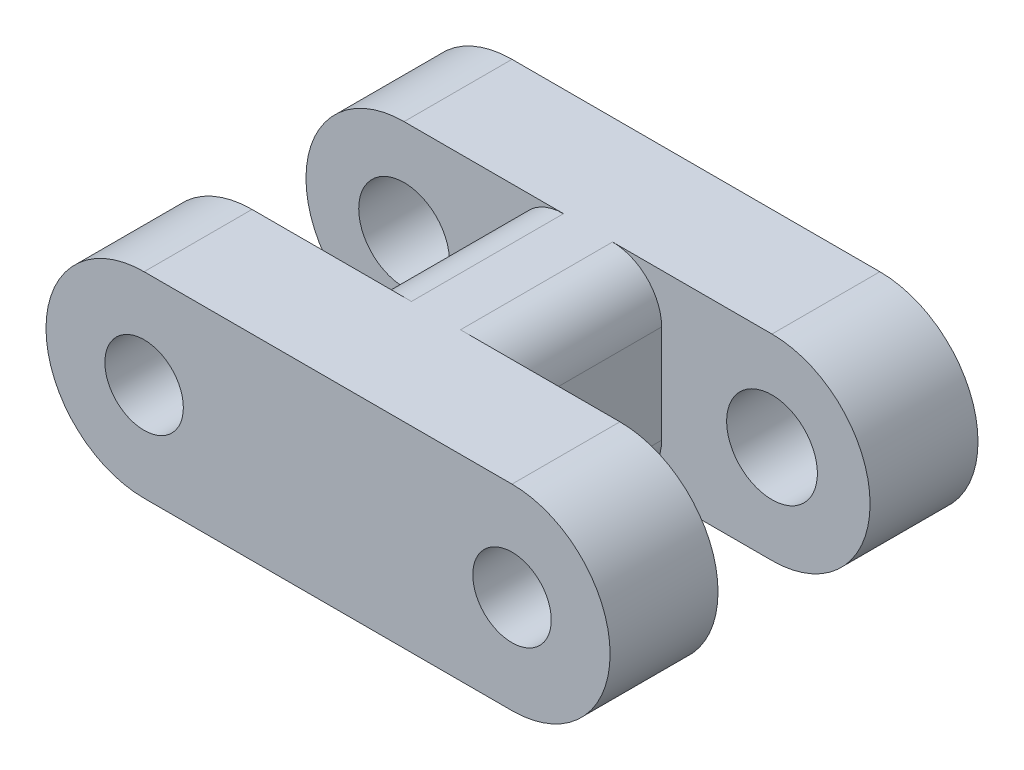
ISO-10303-21;
HEADER;
FILE_DESCRIPTION(('STEP AP214'),'2;1');
FILE_NAME('part.step','',(''),(''),'','','');
FILE_SCHEMA(('AUTOMOTIVE_DESIGN { 1 0 10303 214 1 1 1 1 }'));
ENDSEC;
DATA;
#1=APPLICATION_CONTEXT('core data for automotive mechanical design processes');
#2=APPLICATION_PROTOCOL_DEFINITION('international standard','automotive_design',2000,#1);
#3=PRODUCT_CONTEXT('',#1,'mechanical');
#4=PRODUCT('Part','Part','',(#3));
#5=PRODUCT_RELATED_PRODUCT_CATEGORY('part','',(#4));
#6=PRODUCT_DEFINITION_FORMATION('','',#4);
#7=PRODUCT_DEFINITION_CONTEXT('part definition',#1,'design');
#8=PRODUCT_DEFINITION('design','',#6,#7);
#9=PRODUCT_DEFINITION_SHAPE('','',#8);
#10=(LENGTH_UNIT() NAMED_UNIT(*) SI_UNIT(.MILLI.,.METRE.));
#11=(NAMED_UNIT(*) PLANE_ANGLE_UNIT() SI_UNIT($,.RADIAN.));
#12=(NAMED_UNIT(*) SI_UNIT($,.STERADIAN.) SOLID_ANGLE_UNIT());
#13=UNCERTAINTY_MEASURE_WITH_UNIT(LENGTH_MEASURE(1.E-05),#10,'distance_accuracy_value','');
#14=(GEOMETRIC_REPRESENTATION_CONTEXT(3) GLOBAL_UNCERTAINTY_ASSIGNED_CONTEXT((#13)) GLOBAL_UNIT_ASSIGNED_CONTEXT((#10,
#11,#12)) REPRESENTATION_CONTEXT('',''));
#15=CARTESIAN_POINT('',(0.,0.,0.));
#16=DIRECTION('',(0.,0.,1.));
#17=DIRECTION('',(1.,0.,0.));
#18=AXIS2_PLACEMENT_3D('',#15,#16,#17);
#19=CARTESIAN_POINT('',(-14.9999999999788,0.,-7.5));
#20=DIRECTION('',(0.,0.,1.));
#21=DIRECTION('',(1.,0.,0.));
#22=AXIS2_PLACEMENT_3D('',#19,#20,#21);
#23=PLANE('',#22);
#24=CARTESIAN_POINT('',(0.,0.,-7.5));
#25=DIRECTION('',(0.,0.,-1.));
#26=DIRECTION('',(-1.,0.,0.));
#27=AXIS2_PLACEMENT_3D('',#24,#25,#26);
#28=CIRCLE('',#27,1.85000000000001);
#29=CARTESIAN_POINT('',(-1.85000000000001,0.,-7.5));
#30=VERTEX_POINT('',#29);
#31=EDGE_CURVE('E303',#30,#30,#28,.T.);
#32=ORIENTED_EDGE('',*,*,#31,.F.);
#33=EDGE_LOOP('',(#32));
#34=FACE_BOUND('',#33,.T.);
#35=CARTESIAN_POINT('',(-14.9999999999788,0.,-7.5));
#36=DIRECTION('',(0.,0.,1.));
#37=DIRECTION('',(1.,0.,0.));
#38=AXIS2_PLACEMENT_3D('',#35,#36,#37);
#39=CIRCLE('',#38,4.);
#40=CARTESIAN_POINT('',(-14.9999999999788,4.,-7.5));
#41=VERTEX_POINT('',#40);
#42=CARTESIAN_POINT('',(-14.9999999999788,-4.,-7.5));
#43=VERTEX_POINT('',#42);
#44=EDGE_CURVE('E264',#41,#43,#39,.T.);
#45=ORIENTED_EDGE('',*,*,#44,.F.);
#46=DIRECTION('',(-1.,0.,0.));
#47=VECTOR('',#46,1.);
#48=CARTESIAN_POINT('',(-14.9999999999788,4.,-7.5));
#49=LINE('',#48,#47);
#50=CARTESIAN_POINT('',(0.,4.,-7.5));
#51=VERTEX_POINT('',#50);
#52=EDGE_CURVE('E269',#51,#41,#49,.T.);
#53=ORIENTED_EDGE('',*,*,#52,.F.);
#54=CARTESIAN_POINT('',(0.,0.,-7.5));
#55=DIRECTION('',(0.,0.,1.));
#56=DIRECTION('',(1.,0.,0.));
#57=AXIS2_PLACEMENT_3D('',#54,#55,#56);
#58=CIRCLE('',#57,4.);
#59=CARTESIAN_POINT('',(0.,-4.,-7.5));
#60=VERTEX_POINT('',#59);
#61=EDGE_CURVE('E278',#60,#51,#58,.T.);
#62=ORIENTED_EDGE('',*,*,#61,.F.);
#63=DIRECTION('',(1.,0.,0.));
#64=VECTOR('',#63,1.);
#65=CARTESIAN_POINT('',(0.,-4.,-7.5));
#66=LINE('',#65,#64);
#67=EDGE_CURVE('E174',#43,#60,#66,.T.);
#68=ORIENTED_EDGE('',*,*,#67,.F.);
#69=EDGE_LOOP('',(#45,#53,#62,#68));
#70=FACE_BOUND('',#69,.T.);
#71=CARTESIAN_POINT('',(-14.9999999999788,0.,-7.5));
#72=DIRECTION('',(0.,0.,-1.));
#73=DIRECTION('',(-1.,0.,0.));
#74=AXIS2_PLACEMENT_3D('',#71,#72,#73);
#75=CIRCLE('',#74,1.85000000000001);
#76=CARTESIAN_POINT('',(-16.8499999999788,0.,-7.5));
#77=VERTEX_POINT('',#76);
#78=EDGE_CURVE('E295',#77,#77,#75,.T.);
#79=ORIENTED_EDGE('',*,*,#78,.F.);
#80=EDGE_LOOP('',(#79));
#81=FACE_BOUND('',#80,.T.);
#82=ADVANCED_FACE('F39',(#34,#70,#81),#23,.F.);
#83=CARTESIAN_POINT('',(-14.9999999999788,0.,7.5));
#84=DIRECTION('',(0.,0.,-1.));
#85=DIRECTION('',(-1.,0.,0.));
#86=AXIS2_PLACEMENT_3D('',#83,#84,#85);
#87=CYLINDRICAL_SURFACE('',#86,4.);
#88=DIRECTION('',(0.,0.,-1.));
#89=VECTOR('',#88,1.);
#90=CARTESIAN_POINT('',(-14.9999999999788,-4.,7.5));
#91=LINE('',#90,#89);
#92=CARTESIAN_POINT('',(-14.9999999999788,-4.,-3.1));
#93=VERTEX_POINT('',#92);
#94=EDGE_CURVE('E180',#93,#43,#91,.T.);
#95=ORIENTED_EDGE('',*,*,#94,.F.);
#96=CARTESIAN_POINT('',(-14.9999999999788,0.,-3.1));
#97=DIRECTION('',(0.,0.,-1.));
#98=DIRECTION('',(-1.,0.,0.));
#99=AXIS2_PLACEMENT_3D('',#96,#97,#98);
#100=CIRCLE('',#99,4.);
#101=CARTESIAN_POINT('',(-14.9999999999788,4.,-3.1));
#102=VERTEX_POINT('',#101);
#103=EDGE_CURVE('E256',#93,#102,#100,.T.);
#104=ORIENTED_EDGE('',*,*,#103,.T.);
#105=DIRECTION('',(0.,0.,-1.));
#106=VECTOR('',#105,1.);
#107=CARTESIAN_POINT('',(-14.9999999999788,4.,7.5));
#108=LINE('',#107,#106);
#109=EDGE_CURVE('E244',#102,#41,#108,.T.);
#110=ORIENTED_EDGE('',*,*,#109,.T.);
#111=ORIENTED_EDGE('',*,*,#44,.T.);
#112=EDGE_LOOP('',(#95,#104,#110,#111));
#113=FACE_BOUND('',#112,.T.);
#114=ADVANCED_FACE('F285',(#113),#87,.T.);
#115=CARTESIAN_POINT('',(0.,0.,7.5));
#116=DIRECTION('',(0.,0.,-1.));
#117=DIRECTION('',(-1.,0.,0.));
#118=AXIS2_PLACEMENT_3D('',#115,#116,#117);
#119=CYLINDRICAL_SURFACE('',#118,4.);
#120=DIRECTION('',(0.,0.,-1.));
#121=VECTOR('',#120,1.);
#122=CARTESIAN_POINT('',(0.,-4.,7.5));
#123=LINE('',#122,#121);
#124=CARTESIAN_POINT('',(0.,-4.,7.5));
#125=VERTEX_POINT('',#124);
#126=CARTESIAN_POINT('',(0.,-4.,3.1));
#127=VERTEX_POINT('',#126);
#128=EDGE_CURVE('E176',#125,#127,#123,.T.);
#129=ORIENTED_EDGE('',*,*,#128,.T.);
#130=CARTESIAN_POINT('',(0.,0.,3.1));
#131=DIRECTION('',(0.,0.,1.));
#132=DIRECTION('',(1.,0.,0.));
#133=AXIS2_PLACEMENT_3D('',#130,#131,#132);
#134=CIRCLE('',#133,4.);
#135=CARTESIAN_POINT('',(0.,4.,3.1));
#136=VERTEX_POINT('',#135);
#137=EDGE_CURVE('E190',#127,#136,#134,.T.);
#138=ORIENTED_EDGE('',*,*,#137,.T.);
#139=DIRECTION('',(0.,0.,-1.));
#140=VECTOR('',#139,1.);
#141=CARTESIAN_POINT('',(0.,4.,7.5));
#142=LINE('',#141,#140);
#143=CARTESIAN_POINT('',(0.,4.,7.5));
#144=VERTEX_POINT('',#143);
#145=EDGE_CURVE('E177',#144,#136,#142,.T.);
#146=ORIENTED_EDGE('',*,*,#145,.F.);
#147=CARTESIAN_POINT('',(0.,0.,7.5));
#148=DIRECTION('',(0.,0.,1.));
#149=DIRECTION('',(1.,0.,0.));
#150=AXIS2_PLACEMENT_3D('',#147,#148,#149);
#151=CIRCLE('',#150,4.);
#152=EDGE_CURVE('E271',#125,#144,#151,.T.);
#153=ORIENTED_EDGE('',*,*,#152,.F.);
#154=EDGE_LOOP('',(#129,#138,#146,#153));
#155=FACE_BOUND('',#154,.T.);
#156=ADVANCED_FACE('F341',(#155),#119,.T.);
#157=CARTESIAN_POINT('',(0.,0.,7.5));
#158=DIRECTION('',(0.,0.,-1.));
#159=DIRECTION('',(-1.,0.,0.));
#160=AXIS2_PLACEMENT_3D('',#157,#158,#159);
#161=CYLINDRICAL_SURFACE('',#160,1.6);
#162=CARTESIAN_POINT('',(0.,0.,3.1));
#163=DIRECTION('',(0.,0.,1.));
#164=DIRECTION('',(1.,0.,0.));
#165=AXIS2_PLACEMENT_3D('',#162,#163,#164);
#166=CIRCLE('',#165,1.6);
#167=CARTESIAN_POINT('',(1.6,0.,3.1));
#168=VERTEX_POINT('',#167);
#169=EDGE_CURVE('E169',#168,#168,#166,.T.);
#170=ORIENTED_EDGE('',*,*,#169,.F.);
#171=EDGE_LOOP('',(#170));
#172=FACE_BOUND('',#171,.T.);
#173=CARTESIAN_POINT('',(0.,0.,7.5));
#174=DIRECTION('',(0.,0.,1.));
#175=DIRECTION('',(1.,0.,0.));
#176=AXIS2_PLACEMENT_3D('',#173,#174,#175);
#177=CIRCLE('',#176,1.6);
#178=CARTESIAN_POINT('',(1.6,0.,7.5));
#179=VERTEX_POINT('',#178);
#180=EDGE_CURVE('E258',#179,#179,#177,.T.);
#181=ORIENTED_EDGE('',*,*,#180,.T.);
#182=EDGE_LOOP('',(#181));
#183=FACE_BOUND('',#182,.T.);
#184=ADVANCED_FACE('F377',(#172,#183),#161,.F.);
#185=CARTESIAN_POINT('',(-14.9999999999788,0.,7.5));
#186=DIRECTION('',(0.,0.,1.));
#187=DIRECTION('',(1.,0.,0.));
#188=AXIS2_PLACEMENT_3D('',#185,#186,#187);
#189=PLANE('',#188);
#190=CARTESIAN_POINT('',(-14.9999999999788,0.,7.5));
#191=DIRECTION('',(0.,0.,1.));
#192=DIRECTION('',(1.,0.,0.));
#193=AXIS2_PLACEMENT_3D('',#190,#191,#192);
#194=CIRCLE('',#193,1.59999999997814);
#195=CARTESIAN_POINT('',(-13.4000000000006,0.,7.5));
#196=VERTEX_POINT('',#195);
#197=EDGE_CURVE('E261',#196,#196,#194,.T.);
#198=ORIENTED_EDGE('',*,*,#197,.F.);
#199=EDGE_LOOP('',(#198));
#200=FACE_BOUND('',#199,.T.);
#201=CARTESIAN_POINT('',(-14.9999999999788,0.,7.5));
#202=DIRECTION('',(0.,0.,1.));
#203=DIRECTION('',(1.,0.,0.));
#204=AXIS2_PLACEMENT_3D('',#201,#202,#203);
#205=CIRCLE('',#204,4.);
#206=CARTESIAN_POINT('',(-14.9999999999788,4.,7.5));
#207=VERTEX_POINT('',#206);
#208=CARTESIAN_POINT('',(-14.9999999999788,-4.,7.5));
#209=VERTEX_POINT('',#208);
#210=EDGE_CURVE('E265',#207,#209,#205,.T.);
#211=ORIENTED_EDGE('',*,*,#210,.T.);
#212=DIRECTION('',(1.,0.,0.));
#213=VECTOR('',#212,1.);
#214=CARTESIAN_POINT('',(0.,-4.,7.5));
#215=LINE('',#214,#213);
#216=EDGE_CURVE('E268',#209,#125,#215,.T.);
#217=ORIENTED_EDGE('',*,*,#216,.T.);
#218=ORIENTED_EDGE('',*,*,#152,.T.);
#219=DIRECTION('',(-1.,0.,0.));
#220=VECTOR('',#219,1.);
#221=CARTESIAN_POINT('',(-14.9999999999788,4.,7.5));
#222=LINE('',#221,#220);
#223=EDGE_CURVE('E273',#144,#207,#222,.T.);
#224=ORIENTED_EDGE('',*,*,#223,.T.);
#225=EDGE_LOOP('',(#211,#217,#218,#224));
#226=FACE_BOUND('',#225,.T.);
#227=ORIENTED_EDGE('',*,*,#180,.F.);
#228=EDGE_LOOP('',(#227));
#229=FACE_BOUND('',#228,.T.);
#230=ADVANCED_FACE('F336',(#200,#226,#229),#189,.T.);
#231=CARTESIAN_POINT('',(-14.9999999999788,4.,3.1));
#232=VERTEX_POINT('',#231);
#233=EDGE_CURVE('E280',#207,#232,#108,.T.);
#234=ORIENTED_EDGE('',*,*,#233,.T.);
#235=CARTESIAN_POINT('',(-14.9999999999788,0.,3.1));
#236=DIRECTION('',(0.,0.,1.));
#237=DIRECTION('',(1.,0.,0.));
#238=AXIS2_PLACEMENT_3D('',#235,#236,#237);
#239=CIRCLE('',#238,4.);
#240=CARTESIAN_POINT('',(-14.9999999999788,-4.,3.1));
#241=VERTEX_POINT('',#240);
#242=EDGE_CURVE('E194',#232,#241,#239,.T.);
#243=ORIENTED_EDGE('',*,*,#242,.T.);
#244=EDGE_CURVE('E184',#209,#241,#91,.T.);
#245=ORIENTED_EDGE('',*,*,#244,.F.);
#246=ORIENTED_EDGE('',*,*,#210,.F.);
#247=EDGE_LOOP('',(#234,#243,#245,#246));
#248=FACE_BOUND('',#247,.T.);
#249=ADVANCED_FACE('F332',(#248),#87,.T.);
#250=CARTESIAN_POINT('',(0.,-4.,7.5));
#251=DIRECTION('',(0.,1.,0.));
#252=DIRECTION('',(-1.,0.,0.));
#253=AXIS2_PLACEMENT_3D('',#250,#251,#252);
#254=PLANE('',#253);
#255=DIRECTION('',(0.,0.,1.));
#256=VECTOR('',#255,1.);
#257=CARTESIAN_POINT('',(-6.5,-4.,7.5));
#258=LINE('',#257,#256);
#259=CARTESIAN_POINT('',(-6.5,-4.,-3.1));
#260=VERTEX_POINT('',#259);
#261=CARTESIAN_POINT('',(-6.5,-4.,3.1));
#262=VERTEX_POINT('',#261);
#263=EDGE_CURVE('E197',#260,#262,#258,.T.);
#264=ORIENTED_EDGE('',*,*,#263,.T.);
#265=DIRECTION('',(1.,0.,0.));
#266=VECTOR('',#265,1.);
#267=CARTESIAN_POINT('',(5.5,-4.,3.1));
#268=LINE('',#267,#266);
#269=EDGE_CURVE('E160',#262,#127,#268,.T.);
#270=ORIENTED_EDGE('',*,*,#269,.T.);
#271=ORIENTED_EDGE('',*,*,#128,.F.);
#272=ORIENTED_EDGE('',*,*,#216,.F.);
#273=ORIENTED_EDGE('',*,*,#244,.T.);
#274=DIRECTION('',(1.,0.,0.));
#275=VECTOR('',#274,1.);
#276=CARTESIAN_POINT('',(-20.4999999999788,-4.,3.1));
#277=LINE('',#276,#275);
#278=CARTESIAN_POINT('',(-8.49999999997876,-4.,3.1));
#279=VERTEX_POINT('',#278);
#280=EDGE_CURVE('E245',#241,#279,#277,.T.);
#281=ORIENTED_EDGE('',*,*,#280,.T.);
#282=DIRECTION('',(0.,0.,-1.));
#283=VECTOR('',#282,1.);
#284=CARTESIAN_POINT('',(-8.49999999997876,-4.,7.5));
#285=LINE('',#284,#283);
#286=CARTESIAN_POINT('',(-8.49999999997876,-4.,-3.1));
#287=VERTEX_POINT('',#286);
#288=EDGE_CURVE('E187',#279,#287,#285,.T.);
#289=ORIENTED_EDGE('',*,*,#288,.T.);
#290=DIRECTION('',(-1.,0.,0.));
#291=VECTOR('',#290,1.);
#292=CARTESIAN_POINT('',(-20.4999999999788,-4.,-3.1));
#293=LINE('',#292,#291);
#294=EDGE_CURVE('E248',#287,#93,#293,.T.);
#295=ORIENTED_EDGE('',*,*,#294,.T.);
#296=ORIENTED_EDGE('',*,*,#94,.T.);
#297=ORIENTED_EDGE('',*,*,#67,.T.);
#298=CARTESIAN_POINT('',(0.,-4.,-3.1));
#299=VERTEX_POINT('',#298);
#300=EDGE_CURVE('E166',#299,#60,#123,.T.);
#301=ORIENTED_EDGE('',*,*,#300,.F.);
#302=DIRECTION('',(-1.,0.,0.));
#303=VECTOR('',#302,1.);
#304=CARTESIAN_POINT('',(5.5,-4.,-3.1));
#305=LINE('',#304,#303);
#306=EDGE_CURVE('E149',#299,#260,#305,.T.);
#307=ORIENTED_EDGE('',*,*,#306,.T.);
#308=EDGE_LOOP('',(#264,#270,#271,#272,#273,#281,#289,#295,#296,#297,#301,#307));
#309=FACE_BOUND('',#308,.T.);
#310=ADVANCED_FACE('F172',(#309),#254,.F.);
#311=CARTESIAN_POINT('',(0.,4.,-3.1));
#312=VERTEX_POINT('',#311);
#313=EDGE_CURVE('E168',#312,#51,#142,.T.);
#314=ORIENTED_EDGE('',*,*,#313,.F.);
#315=CARTESIAN_POINT('',(0.,0.,-3.1));
#316=DIRECTION('',(0.,0.,-1.));
#317=DIRECTION('',(-1.,0.,0.));
#318=AXIS2_PLACEMENT_3D('',#315,#316,#317);
#319=CIRCLE('',#318,4.);
#320=EDGE_CURVE('E152',#312,#299,#319,.T.);
#321=ORIENTED_EDGE('',*,*,#320,.T.);
#322=ORIENTED_EDGE('',*,*,#300,.T.);
#323=ORIENTED_EDGE('',*,*,#61,.T.);
#324=EDGE_LOOP('',(#314,#321,#322,#323));
#325=FACE_BOUND('',#324,.T.);
#326=ADVANCED_FACE('F164',(#325),#119,.T.);
#327=CARTESIAN_POINT('',(-14.9999999999788,4.,7.5));
#328=DIRECTION('',(0.,-1.,0.));
#329=DIRECTION('',(1.,0.,0.));
#330=AXIS2_PLACEMENT_3D('',#327,#328,#329);
#331=PLANE('',#330);
#332=DIRECTION('',(1.,0.,0.));
#333=VECTOR('',#332,1.);
#334=CARTESIAN_POINT('',(5.5,4.,3.1));
#335=LINE('',#334,#333);
#336=CARTESIAN_POINT('',(-6.5,4.,3.1));
#337=VERTEX_POINT('',#336);
#338=EDGE_CURVE('E54',#337,#136,#335,.T.);
#339=ORIENTED_EDGE('',*,*,#338,.F.);
#340=DIRECTION('',(0.,0.,1.));
#341=VECTOR('',#340,1.);
#342=CARTESIAN_POINT('',(-6.5,4.,7.5));
#343=LINE('',#342,#341);
#344=CARTESIAN_POINT('',(-6.5,4.,-3.1));
#345=VERTEX_POINT('',#344);
#346=EDGE_CURVE('E212',#337,#345,#343,.F.);
#347=ORIENTED_EDGE('',*,*,#346,.T.);
#348=DIRECTION('',(-1.,0.,0.));
#349=VECTOR('',#348,1.);
#350=CARTESIAN_POINT('',(5.5,4.,-3.1));
#351=LINE('',#350,#349);
#352=EDGE_CURVE('E62',#312,#345,#351,.T.);
#353=ORIENTED_EDGE('',*,*,#352,.F.);
#354=ORIENTED_EDGE('',*,*,#313,.T.);
#355=ORIENTED_EDGE('',*,*,#52,.T.);
#356=ORIENTED_EDGE('',*,*,#109,.F.);
#357=DIRECTION('',(-1.,0.,0.));
#358=VECTOR('',#357,1.);
#359=CARTESIAN_POINT('',(-20.4999999999788,4.,-3.1));
#360=LINE('',#359,#358);
#361=CARTESIAN_POINT('',(-8.49999999997876,4.,-3.1));
#362=VERTEX_POINT('',#361);
#363=EDGE_CURVE('E230',#362,#102,#360,.T.);
#364=ORIENTED_EDGE('',*,*,#363,.F.);
#365=DIRECTION('',(0.,0.,-1.));
#366=VECTOR('',#365,1.);
#367=CARTESIAN_POINT('',(-8.49999999997876,4.,7.5));
#368=LINE('',#367,#366);
#369=CARTESIAN_POINT('',(-8.49999999997876,4.,3.1));
#370=VERTEX_POINT('',#369);
#371=EDGE_CURVE('E209',#362,#370,#368,.F.);
#372=ORIENTED_EDGE('',*,*,#371,.T.);
#373=DIRECTION('',(1.,0.,0.));
#374=VECTOR('',#373,1.);
#375=CARTESIAN_POINT('',(-20.4999999999788,4.,3.1));
#376=LINE('',#375,#374);
#377=EDGE_CURVE('E240',#232,#370,#376,.T.);
#378=ORIENTED_EDGE('',*,*,#377,.F.);
#379=ORIENTED_EDGE('',*,*,#233,.F.);
#380=ORIENTED_EDGE('',*,*,#223,.F.);
#381=ORIENTED_EDGE('',*,*,#145,.T.);
#382=EDGE_LOOP('',(#339,#347,#353,#354,#355,#356,#364,#372,#378,#379,#380,#381));
#383=FACE_BOUND('',#382,.T.);
#384=ADVANCED_FACE('F238',(#383),#331,.F.);
#385=CARTESIAN_POINT('',(-14.9999999999788,0.,7.5));
#386=DIRECTION('',(0.,0.,-1.));
#387=DIRECTION('',(-1.,0.,0.));
#388=AXIS2_PLACEMENT_3D('',#385,#386,#387);
#389=CYLINDRICAL_SURFACE('',#388,1.59999999997814);
#390=CARTESIAN_POINT('',(-14.9999999999788,0.,3.1));
#391=DIRECTION('',(0.,0.,1.));
#392=DIRECTION('',(1.,0.,0.));
#393=AXIS2_PLACEMENT_3D('',#390,#391,#392);
#394=CIRCLE('',#393,1.59999999997814);
#395=CARTESIAN_POINT('',(-13.4000000000006,0.,3.1));
#396=VERTEX_POINT('',#395);
#397=EDGE_CURVE('E191',#396,#396,#394,.T.);
#398=ORIENTED_EDGE('',*,*,#397,.F.);
#399=EDGE_LOOP('',(#398));
#400=FACE_BOUND('',#399,.T.);
#401=ORIENTED_EDGE('',*,*,#197,.T.);
#402=EDGE_LOOP('',(#401));
#403=FACE_BOUND('',#402,.T.);
#404=ADVANCED_FACE('F373',(#400,#403),#389,.F.);
#405=CARTESIAN_POINT('',(5.5,-4.,3.1));
#406=DIRECTION('',(0.,0.,1.));
#407=DIRECTION('',(1.,0.,0.));
#408=AXIS2_PLACEMENT_3D('',#405,#406,#407);
#409=PLANE('',#408);
#410=ORIENTED_EDGE('',*,*,#169,.T.);
#411=EDGE_LOOP('',(#410));
#412=FACE_BOUND('',#411,.T.);
#413=ORIENTED_EDGE('',*,*,#269,.F.);
#414=CARTESIAN_POINT('',(-6.5,-2.,3.1));
#415=DIRECTION('',(0.,0.,1.));
#416=DIRECTION('',(1.,0.,0.));
#417=AXIS2_PLACEMENT_3D('',#414,#415,#416);
#418=CIRCLE('',#417,2.);
#419=CARTESIAN_POINT('',(-4.5,-2.,3.1));
#420=VERTEX_POINT('',#419);
#421=EDGE_CURVE('E214',#262,#420,#418,.T.);
#422=ORIENTED_EDGE('',*,*,#421,.T.);
#423=DIRECTION('',(0.,1.,0.));
#424=VECTOR('',#423,1.);
#425=CARTESIAN_POINT('',(-4.5,-4.,3.1));
#426=LINE('',#425,#424);
#427=CARTESIAN_POINT('',(-4.5,2.,3.1));
#428=VERTEX_POINT('',#427);
#429=EDGE_CURVE('E170',#420,#428,#426,.T.);
#430=ORIENTED_EDGE('',*,*,#429,.T.);
#431=CARTESIAN_POINT('',(-6.5,2.,3.1));
#432=DIRECTION('',(0.,0.,1.));
#433=DIRECTION('',(1.,0.,0.));
#434=AXIS2_PLACEMENT_3D('',#431,#432,#433);
#435=CIRCLE('',#434,2.);
#436=EDGE_CURVE('E222',#428,#337,#435,.T.);
#437=ORIENTED_EDGE('',*,*,#436,.T.);
#438=ORIENTED_EDGE('',*,*,#338,.T.);
#439=ORIENTED_EDGE('',*,*,#137,.F.);
#440=EDGE_LOOP('',(#413,#422,#430,#437,#438,#439));
#441=FACE_BOUND('',#440,.T.);
#442=ADVANCED_FACE('F343',(#412,#441),#409,.F.);
#443=CARTESIAN_POINT('',(5.5,-4.,-3.1));
#444=DIRECTION('',(0.,0.,-1.));
#445=DIRECTION('',(-1.,0.,0.));
#446=AXIS2_PLACEMENT_3D('',#443,#444,#445);
#447=PLANE('',#446);
#448=CARTESIAN_POINT('',(0.,0.,-3.1));
#449=DIRECTION('',(0.,0.,-1.));
#450=DIRECTION('',(-1.,0.,0.));
#451=AXIS2_PLACEMENT_3D('',#448,#449,#450);
#452=CIRCLE('',#451,1.85000000000001);
#453=CARTESIAN_POINT('',(-1.85000000000001,0.,-3.1));
#454=VERTEX_POINT('',#453);
#455=EDGE_CURVE('E298',#454,#454,#452,.T.);
#456=ORIENTED_EDGE('',*,*,#455,.T.);
#457=EDGE_LOOP('',(#456));
#458=FACE_BOUND('',#457,.T.);
#459=ORIENTED_EDGE('',*,*,#352,.T.);
#460=CARTESIAN_POINT('',(-6.5,2.,-3.1));
#461=DIRECTION('',(0.,0.,-1.));
#462=DIRECTION('',(-1.,0.,0.));
#463=AXIS2_PLACEMENT_3D('',#460,#461,#462);
#464=CIRCLE('',#463,2.);
#465=CARTESIAN_POINT('',(-4.5,2.,-3.1));
#466=VERTEX_POINT('',#465);
#467=EDGE_CURVE('E224',#345,#466,#464,.T.);
#468=ORIENTED_EDGE('',*,*,#467,.T.);
#469=DIRECTION('',(0.,1.,0.));
#470=VECTOR('',#469,1.);
#471=CARTESIAN_POINT('',(-4.5,-4.,-3.1));
#472=LINE('',#471,#470);
#473=CARTESIAN_POINT('',(-4.5,-2.,-3.1));
#474=VERTEX_POINT('',#473);
#475=EDGE_CURVE('E311',#474,#466,#472,.T.);
#476=ORIENTED_EDGE('',*,*,#475,.F.);
#477=CARTESIAN_POINT('',(-6.5,-2.,-3.1));
#478=DIRECTION('',(0.,0.,-1.));
#479=DIRECTION('',(-1.,0.,0.));
#480=AXIS2_PLACEMENT_3D('',#477,#478,#479);
#481=CIRCLE('',#480,2.);
#482=EDGE_CURVE('E155',#474,#260,#481,.T.);
#483=ORIENTED_EDGE('',*,*,#482,.T.);
#484=ORIENTED_EDGE('',*,*,#306,.F.);
#485=ORIENTED_EDGE('',*,*,#320,.F.);
#486=EDGE_LOOP('',(#459,#468,#476,#483,#484,#485));
#487=FACE_BOUND('',#486,.T.);
#488=ADVANCED_FACE('F151',(#458,#487),#447,.F.);
#489=CARTESIAN_POINT('',(-4.5,-4.,-3.1));
#490=DIRECTION('',(-1.,0.,0.));
#491=DIRECTION('',(0.,0.,1.));
#492=AXIS2_PLACEMENT_3D('',#489,#490,#491);
#493=PLANE('',#492);
#494=ORIENTED_EDGE('',*,*,#429,.F.);
#495=DIRECTION('',(0.,0.,1.));
#496=VECTOR('',#495,1.);
#497=CARTESIAN_POINT('',(-4.5,-2.,-3.1));
#498=LINE('',#497,#496);
#499=EDGE_CURVE('E202',#420,#474,#498,.F.);
#500=ORIENTED_EDGE('',*,*,#499,.T.);
#501=ORIENTED_EDGE('',*,*,#475,.T.);
#502=DIRECTION('',(0.,0.,1.));
#503=VECTOR('',#502,1.);
#504=CARTESIAN_POINT('',(-4.5,2.,-3.1));
#505=LINE('',#504,#503);
#506=EDGE_CURVE('E199',#466,#428,#505,.T.);
#507=ORIENTED_EDGE('',*,*,#506,.T.);
#508=EDGE_LOOP('',(#494,#500,#501,#507));
#509=FACE_BOUND('',#508,.T.);
#510=ADVANCED_FACE('F350',(#509),#493,.F.);
#511=CARTESIAN_POINT('',(-20.4999999999788,-4.,-3.1));
#512=DIRECTION('',(0.,0.,-1.));
#513=DIRECTION('',(-1.,0.,0.));
#514=AXIS2_PLACEMENT_3D('',#511,#512,#513);
#515=PLANE('',#514);
#516=CARTESIAN_POINT('',(-14.9999999999788,0.,-3.1));
#517=DIRECTION('',(0.,0.,-1.));
#518=DIRECTION('',(-1.,0.,0.));
#519=AXIS2_PLACEMENT_3D('',#516,#517,#518);
#520=CIRCLE('',#519,1.85000000000001);
#521=CARTESIAN_POINT('',(-16.8499999999788,0.,-3.1));
#522=VERTEX_POINT('',#521);
#523=EDGE_CURVE('E297',#522,#522,#520,.T.);
#524=ORIENTED_EDGE('',*,*,#523,.T.);
#525=EDGE_LOOP('',(#524));
#526=FACE_BOUND('',#525,.T.);
#527=ORIENTED_EDGE('',*,*,#294,.F.);
#528=CARTESIAN_POINT('',(-8.49999999997876,-2.,-3.1));
#529=DIRECTION('',(0.,0.,-1.));
#530=DIRECTION('',(-1.,0.,0.));
#531=AXIS2_PLACEMENT_3D('',#528,#529,#530);
#532=CIRCLE('',#531,2.);
#533=CARTESIAN_POINT('',(-10.4999999999788,-2.,-3.1));
#534=VERTEX_POINT('',#533);
#535=EDGE_CURVE('E217',#287,#534,#532,.T.);
#536=ORIENTED_EDGE('',*,*,#535,.T.);
#537=DIRECTION('',(0.,1.,0.));
#538=VECTOR('',#537,1.);
#539=CARTESIAN_POINT('',(-10.4999999999788,-4.,-3.1));
#540=LINE('',#539,#538);
#541=CARTESIAN_POINT('',(-10.4999999999788,2.,-3.1));
#542=VERTEX_POINT('',#541);
#543=EDGE_CURVE('E233',#534,#542,#540,.T.);
#544=ORIENTED_EDGE('',*,*,#543,.T.);
#545=CARTESIAN_POINT('',(-8.49999999997876,2.,-3.1));
#546=DIRECTION('',(0.,0.,-1.));
#547=DIRECTION('',(-1.,0.,0.));
#548=AXIS2_PLACEMENT_3D('',#545,#546,#547);
#549=CIRCLE('',#548,2.);
#550=EDGE_CURVE('E47',#542,#362,#549,.T.);
#551=ORIENTED_EDGE('',*,*,#550,.T.);
#552=ORIENTED_EDGE('',*,*,#363,.T.);
#553=ORIENTED_EDGE('',*,*,#103,.F.);
#554=EDGE_LOOP('',(#527,#536,#544,#551,#552,#553));
#555=FACE_BOUND('',#554,.T.);
#556=ADVANCED_FACE('F229',(#526,#555),#515,.F.);
#557=CARTESIAN_POINT('',(-20.4999999999788,-4.,3.1));
#558=DIRECTION('',(0.,0.,1.));
#559=DIRECTION('',(1.,0.,0.));
#560=AXIS2_PLACEMENT_3D('',#557,#558,#559);
#561=PLANE('',#560);
#562=ORIENTED_EDGE('',*,*,#397,.T.);
#563=EDGE_LOOP('',(#562));
#564=FACE_BOUND('',#563,.T.);
#565=ORIENTED_EDGE('',*,*,#377,.T.);
#566=CARTESIAN_POINT('',(-8.49999999997876,2.,3.1));
#567=DIRECTION('',(0.,0.,1.));
#568=DIRECTION('',(1.,0.,0.));
#569=AXIS2_PLACEMENT_3D('',#566,#567,#568);
#570=CIRCLE('',#569,2.);
#571=CARTESIAN_POINT('',(-10.4999999999788,2.,3.1));
#572=VERTEX_POINT('',#571);
#573=EDGE_CURVE('E11',#370,#572,#570,.T.);
#574=ORIENTED_EDGE('',*,*,#573,.T.);
#575=DIRECTION('',(0.,1.,0.));
#576=VECTOR('',#575,1.);
#577=CARTESIAN_POINT('',(-10.4999999999788,-4.,3.1));
#578=LINE('',#577,#576);
#579=CARTESIAN_POINT('',(-10.4999999999788,-2.,3.1));
#580=VERTEX_POINT('',#579);
#581=EDGE_CURVE('E316',#580,#572,#578,.T.);
#582=ORIENTED_EDGE('',*,*,#581,.F.);
#583=CARTESIAN_POINT('',(-8.49999999997876,-2.,3.1));
#584=DIRECTION('',(0.,0.,1.));
#585=DIRECTION('',(1.,0.,0.));
#586=AXIS2_PLACEMENT_3D('',#583,#584,#585);
#587=CIRCLE('',#586,2.);
#588=EDGE_CURVE('E219',#580,#279,#587,.T.);
#589=ORIENTED_EDGE('',*,*,#588,.T.);
#590=ORIENTED_EDGE('',*,*,#280,.F.);
#591=ORIENTED_EDGE('',*,*,#242,.F.);
#592=EDGE_LOOP('',(#565,#574,#582,#589,#590,#591));
#593=FACE_BOUND('',#592,.T.);
#594=ADVANCED_FACE('F330',(#564,#593),#561,.F.);
#595=CARTESIAN_POINT('',(-10.4999999999788,-4.,-3.1));
#596=DIRECTION('',(1.,0.,0.));
#597=DIRECTION('',(0.,0.,-1.));
#598=AXIS2_PLACEMENT_3D('',#595,#596,#597);
#599=PLANE('',#598);
#600=ORIENTED_EDGE('',*,*,#543,.F.);
#601=DIRECTION('',(0.,0.,-1.));
#602=VECTOR('',#601,1.);
#603=CARTESIAN_POINT('',(-10.4999999999788,-2.,-3.1));
#604=LINE('',#603,#602);
#605=EDGE_CURVE('E207',#534,#580,#604,.F.);
#606=ORIENTED_EDGE('',*,*,#605,.T.);
#607=ORIENTED_EDGE('',*,*,#581,.T.);
#608=DIRECTION('',(0.,0.,-1.));
#609=VECTOR('',#608,1.);
#610=CARTESIAN_POINT('',(-10.4999999999788,2.,-3.1));
#611=LINE('',#610,#609);
#612=EDGE_CURVE('E204',#572,#542,#611,.T.);
#613=ORIENTED_EDGE('',*,*,#612,.T.);
#614=EDGE_LOOP('',(#600,#606,#607,#613));
#615=FACE_BOUND('',#614,.T.);
#616=ADVANCED_FACE('F328',(#615),#599,.F.);
#617=CARTESIAN_POINT('',(-14.9999999999788,0.,-7.5));
#618=DIRECTION('',(0.,0.,-1.));
#619=DIRECTION('',(-1.,0.,0.));
#620=AXIS2_PLACEMENT_3D('',#617,#618,#619);
#621=CYLINDRICAL_SURFACE('',#620,1.85000000000001);
#622=ORIENTED_EDGE('',*,*,#523,.F.);
#623=EDGE_LOOP('',(#622));
#624=FACE_BOUND('',#623,.T.);
#625=ORIENTED_EDGE('',*,*,#78,.T.);
#626=EDGE_LOOP('',(#625));
#627=FACE_BOUND('',#626,.T.);
#628=ADVANCED_FACE('F390',(#624,#627),#621,.F.);
#629=CARTESIAN_POINT('',(0.,0.,-7.5));
#630=DIRECTION('',(0.,0.,-1.));
#631=DIRECTION('',(-1.,0.,0.));
#632=AXIS2_PLACEMENT_3D('',#629,#630,#631);
#633=CYLINDRICAL_SURFACE('',#632,1.85000000000001);
#634=ORIENTED_EDGE('',*,*,#455,.F.);
#635=EDGE_LOOP('',(#634));
#636=FACE_BOUND('',#635,.T.);
#637=ORIENTED_EDGE('',*,*,#31,.T.);
#638=EDGE_LOOP('',(#637));
#639=FACE_BOUND('',#638,.T.);
#640=ADVANCED_FACE('F365',(#636,#639),#633,.F.);
#641=CARTESIAN_POINT('',(-6.5,-2.,7.5));
#642=DIRECTION('',(0.,0.,1.));
#643=DIRECTION('',(1.,0.,0.));
#644=AXIS2_PLACEMENT_3D('',#641,#642,#643);
#645=CYLINDRICAL_SURFACE('',#644,2.);
#646=ORIENTED_EDGE('',*,*,#482,.F.);
#647=ORIENTED_EDGE('',*,*,#499,.F.);
#648=ORIENTED_EDGE('',*,*,#421,.F.);
#649=ORIENTED_EDGE('',*,*,#263,.F.);
#650=EDGE_LOOP('',(#646,#647,#648,#649));
#651=FACE_BOUND('',#650,.T.);
#652=ADVANCED_FACE('F346',(#651),#645,.T.);
#653=CARTESIAN_POINT('',(-8.49999999997876,-2.,7.5));
#654=DIRECTION('',(0.,0.,-1.));
#655=DIRECTION('',(-1.,0.,0.));
#656=AXIS2_PLACEMENT_3D('',#653,#654,#655);
#657=CYLINDRICAL_SURFACE('',#656,2.);
#658=ORIENTED_EDGE('',*,*,#588,.F.);
#659=ORIENTED_EDGE('',*,*,#605,.F.);
#660=ORIENTED_EDGE('',*,*,#535,.F.);
#661=ORIENTED_EDGE('',*,*,#288,.F.);
#662=EDGE_LOOP('',(#658,#659,#660,#661));
#663=FACE_BOUND('',#662,.T.);
#664=ADVANCED_FACE('F325',(#663),#657,.T.);
#665=CARTESIAN_POINT('',(-6.5,2.,-3.1));
#666=DIRECTION('',(0.,0.,1.));
#667=DIRECTION('',(1.,0.,0.));
#668=AXIS2_PLACEMENT_3D('',#665,#666,#667);
#669=CYLINDRICAL_SURFACE('',#668,2.);
#670=ORIENTED_EDGE('',*,*,#467,.F.);
#671=ORIENTED_EDGE('',*,*,#346,.F.);
#672=ORIENTED_EDGE('',*,*,#436,.F.);
#673=ORIENTED_EDGE('',*,*,#506,.F.);
#674=EDGE_LOOP('',(#670,#671,#672,#673));
#675=FACE_BOUND('',#674,.T.);
#676=ADVANCED_FACE('F354',(#675),#669,.T.);
#677=CARTESIAN_POINT('',(-8.49999999997876,2.,-3.1));
#678=DIRECTION('',(0.,0.,-1.));
#679=DIRECTION('',(-1.,0.,0.));
#680=AXIS2_PLACEMENT_3D('',#677,#678,#679);
#681=CYLINDRICAL_SURFACE('',#680,2.);
#682=ORIENTED_EDGE('',*,*,#573,.F.);
#683=ORIENTED_EDGE('',*,*,#371,.F.);
#684=ORIENTED_EDGE('',*,*,#550,.F.);
#685=ORIENTED_EDGE('',*,*,#612,.F.);
#686=EDGE_LOOP('',(#682,#683,#684,#685));
#687=FACE_BOUND('',#686,.T.);
#688=ADVANCED_FACE('F41',(#687),#681,.T.);
#689=CLOSED_SHELL('',(#82,#114,#156,#184,#230,#249,#310,#326,#384,#404,#442,#488,#510,#556,#594,
#616,#628,#640,#652,#664,#676,#688));
#690=MANIFOLD_SOLID_BREP('B2',#689);
#691=ADVANCED_BREP_SHAPE_REPRESENTATION('',(#18,#690),#14);
#692=SHAPE_DEFINITION_REPRESENTATION(#9,#691);
ENDSEC;
END-ISO-10303-21;
